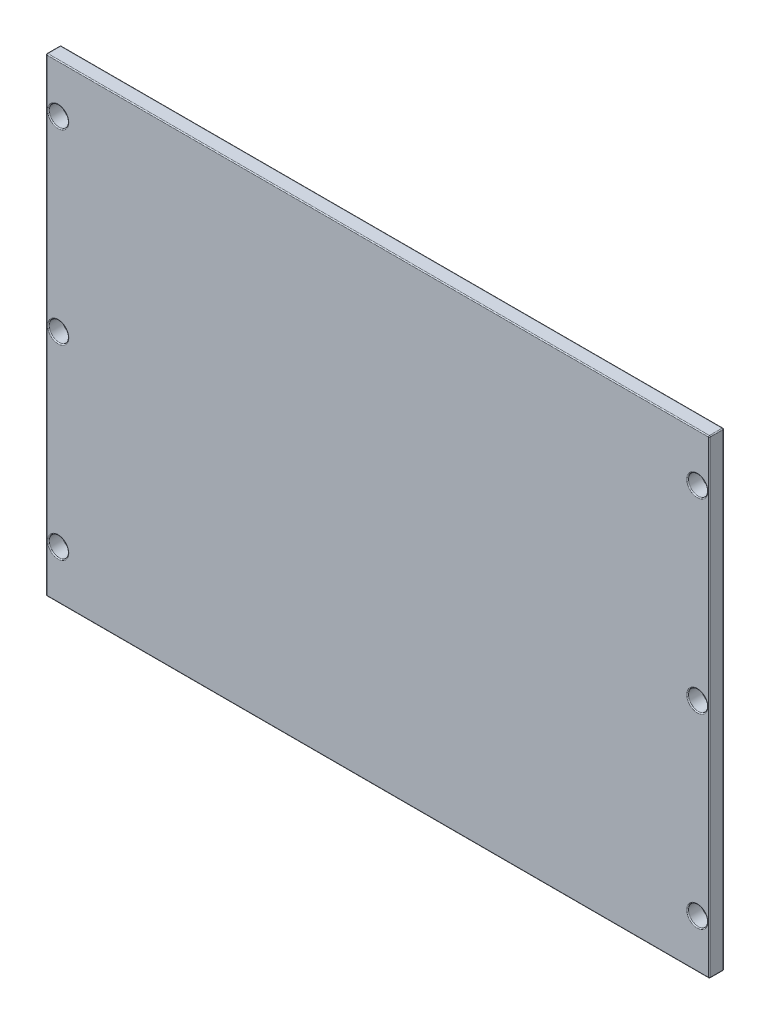
ISO-10303-21;
HEADER;
FILE_DESCRIPTION(('STEP AP214'),'2;1');
FILE_NAME('part.step','',(''),(''),'','','');
FILE_SCHEMA(('AUTOMOTIVE_DESIGN { 1 0 10303 214 1 1 1 1 }'));
ENDSEC;
DATA;
#1=APPLICATION_CONTEXT('core data for automotive mechanical design processes');
#2=APPLICATION_PROTOCOL_DEFINITION('international standard','automotive_design',2000,#1);
#3=PRODUCT_CONTEXT('',#1,'mechanical');
#4=PRODUCT('Part','Part','',(#3));
#5=PRODUCT_RELATED_PRODUCT_CATEGORY('part','',(#4));
#6=PRODUCT_DEFINITION_FORMATION('','',#4);
#7=PRODUCT_DEFINITION_CONTEXT('part definition',#1,'design');
#8=PRODUCT_DEFINITION('design','',#6,#7);
#9=PRODUCT_DEFINITION_SHAPE('','',#8);
#10=(LENGTH_UNIT() NAMED_UNIT(*) SI_UNIT(.MILLI.,.METRE.));
#11=(NAMED_UNIT(*) PLANE_ANGLE_UNIT() SI_UNIT($,.RADIAN.));
#12=(NAMED_UNIT(*) SI_UNIT($,.STERADIAN.) SOLID_ANGLE_UNIT());
#13=UNCERTAINTY_MEASURE_WITH_UNIT(LENGTH_MEASURE(1.E-05),#10,'distance_accuracy_value','');
#14=(GEOMETRIC_REPRESENTATION_CONTEXT(3) GLOBAL_UNCERTAINTY_ASSIGNED_CONTEXT((#13)) GLOBAL_UNIT_ASSIGNED_CONTEXT((#10,
#11,#12)) REPRESENTATION_CONTEXT('',''));
#15=CARTESIAN_POINT('',(0.,0.,0.));
#16=DIRECTION('',(0.,0.,1.));
#17=DIRECTION('',(1.,0.,0.));
#18=AXIS2_PLACEMENT_3D('',#15,#16,#17);
#19=CARTESIAN_POINT('',(167.,2.98999999999998,-197.));
#20=DIRECTION('',(0.,0.,-1.));
#21=DIRECTION('',(-1.,0.,0.));
#22=AXIS2_PLACEMENT_3D('',#19,#20,#21);
#23=PLANE('',#22);
#24=CARTESIAN_POINT('',(32.5,90.,-197.));
#25=DIRECTION('',(0.,0.,-1.));
#26=DIRECTION('',(-1.,0.,0.));
#27=AXIS2_PLACEMENT_3D('',#24,#25,#26);
#28=CIRCLE('',#27,2.2);
#29=CARTESIAN_POINT('',(30.3,90.,-197.));
#30=VERTEX_POINT('',#29);
#31=EDGE_CURVE('E11',#30,#30,#28,.T.);
#32=ORIENTED_EDGE('',*,*,#31,.T.);
#33=EDGE_LOOP('',(#32));
#34=FACE_BOUND('',#33,.T.);
#35=CARTESIAN_POINT('',(32.5,51.5,-197.));
#36=DIRECTION('',(0.,0.,-1.));
#37=DIRECTION('',(-1.,0.,0.));
#38=AXIS2_PLACEMENT_3D('',#35,#36,#37);
#39=CIRCLE('',#38,2.2);
#40=CARTESIAN_POINT('',(30.3,51.5,-197.));
#41=VERTEX_POINT('',#40);
#42=EDGE_CURVE('E44',#41,#41,#39,.T.);
#43=ORIENTED_EDGE('',*,*,#42,.T.);
#44=EDGE_LOOP('',(#43));
#45=FACE_BOUND('',#44,.T.);
#46=CARTESIAN_POINT('',(32.5,13.,-197.));
#47=DIRECTION('',(0.,0.,-1.));
#48=DIRECTION('',(-1.,0.,0.));
#49=AXIS2_PLACEMENT_3D('',#46,#47,#48);
#50=CIRCLE('',#49,2.2);
#51=CARTESIAN_POINT('',(30.3,13.,-197.));
#52=VERTEX_POINT('',#51);
#53=EDGE_CURVE('E268',#52,#52,#50,.T.);
#54=ORIENTED_EDGE('',*,*,#53,.T.);
#55=EDGE_LOOP('',(#54));
#56=FACE_BOUND('',#55,.T.);
#57=CARTESIAN_POINT('',(164.5,13.,-197.));
#58=DIRECTION('',(0.,0.,-1.));
#59=DIRECTION('',(-1.,0.,0.));
#60=AXIS2_PLACEMENT_3D('',#57,#58,#59);
#61=CIRCLE('',#60,2.2);
#62=CARTESIAN_POINT('',(162.3,13.,-197.));
#63=VERTEX_POINT('',#62);
#64=EDGE_CURVE('E265',#63,#63,#61,.T.);
#65=ORIENTED_EDGE('',*,*,#64,.T.);
#66=EDGE_LOOP('',(#65));
#67=FACE_BOUND('',#66,.T.);
#68=CARTESIAN_POINT('',(164.5,51.5,-197.));
#69=DIRECTION('',(0.,0.,-1.));
#70=DIRECTION('',(-1.,0.,0.));
#71=AXIS2_PLACEMENT_3D('',#68,#69,#70);
#72=CIRCLE('',#71,2.2);
#73=CARTESIAN_POINT('',(162.3,51.5,-197.));
#74=VERTEX_POINT('',#73);
#75=EDGE_CURVE('E262',#74,#74,#72,.T.);
#76=ORIENTED_EDGE('',*,*,#75,.T.);
#77=EDGE_LOOP('',(#76));
#78=FACE_BOUND('',#77,.T.);
#79=CARTESIAN_POINT('',(164.5,90.,-197.));
#80=DIRECTION('',(0.,0.,-1.));
#81=DIRECTION('',(-1.,0.,0.));
#82=AXIS2_PLACEMENT_3D('',#79,#80,#81);
#83=CIRCLE('',#82,2.2);
#84=CARTESIAN_POINT('',(162.3,90.,-197.));
#85=VERTEX_POINT('',#84);
#86=EDGE_CURVE('E259',#85,#85,#83,.T.);
#87=ORIENTED_EDGE('',*,*,#86,.T.);
#88=EDGE_LOOP('',(#87));
#89=FACE_BOUND('',#88,.T.);
#90=DIRECTION('',(0.,1.,0.));
#91=VECTOR('',#90,1.);
#92=CARTESIAN_POINT('',(30.2,2.98999999999998,-197.));
#93=LINE('',#92,#91);
#94=CARTESIAN_POINT('',(30.2,99.8,-197.));
#95=VERTEX_POINT('',#94);
#96=CARTESIAN_POINT('',(30.2,3.2,-197.));
#97=VERTEX_POINT('',#96);
#98=EDGE_CURVE('E52',#95,#97,#93,.F.);
#99=ORIENTED_EDGE('',*,*,#98,.T.);
#100=DIRECTION('',(-1.,0.,0.));
#101=VECTOR('',#100,1.);
#102=CARTESIAN_POINT('',(167.,3.19999999999998,-197.));
#103=LINE('',#102,#101);
#104=CARTESIAN_POINT('',(166.8,3.19999999999998,-197.));
#105=VERTEX_POINT('',#104);
#106=EDGE_CURVE('E257',#97,#105,#103,.F.);
#107=ORIENTED_EDGE('',*,*,#106,.T.);
#108=DIRECTION('',(0.,1.,0.));
#109=VECTOR('',#108,1.);
#110=CARTESIAN_POINT('',(166.8,2.98999999999998,-197.));
#111=LINE('',#110,#109);
#112=CARTESIAN_POINT('',(166.8,99.8,-197.));
#113=VERTEX_POINT('',#112);
#114=EDGE_CURVE('E253',#105,#113,#111,.T.);
#115=ORIENTED_EDGE('',*,*,#114,.T.);
#116=DIRECTION('',(-1.,0.,0.));
#117=VECTOR('',#116,1.);
#118=CARTESIAN_POINT('',(167.,99.8,-197.));
#119=LINE('',#118,#117);
#120=EDGE_CURVE('E57',#113,#95,#119,.T.);
#121=ORIENTED_EDGE('',*,*,#120,.T.);
#122=EDGE_LOOP('',(#99,#107,#115,#121));
#123=FACE_BOUND('',#122,.T.);
#124=ADVANCED_FACE('F35',(#34,#45,#56,#67,#78,#89,#123),#23,.F.);
#125=CARTESIAN_POINT('',(30.,2.98999999999998,-206.202765486301));
#126=DIRECTION('',(1.,0.,0.));
#127=DIRECTION('',(0.,0.,-1.));
#128=AXIS2_PLACEMENT_3D('',#125,#126,#127);
#129=PLANE('',#128);
#130=DIRECTION('',(0.,0.,1.));
#131=VECTOR('',#130,1.);
#132=CARTESIAN_POINT('',(30.,99.8,-206.202765486301));
#133=LINE('',#132,#131);
#134=CARTESIAN_POINT('',(30.,99.8,-197.2));
#135=VERTEX_POINT('',#134);
#136=CARTESIAN_POINT('',(30.,99.8,-199.8));
#137=VERTEX_POINT('',#136);
#138=EDGE_CURVE('E183',#135,#137,#133,.F.);
#139=ORIENTED_EDGE('',*,*,#138,.T.);
#140=DIRECTION('',(0.,1.,0.));
#141=VECTOR('',#140,1.);
#142=CARTESIAN_POINT('',(30.,2.98999999999998,-199.8));
#143=LINE('',#142,#141);
#144=CARTESIAN_POINT('',(30.,3.2,-199.8));
#145=VERTEX_POINT('',#144);
#146=EDGE_CURVE('E188',#137,#145,#143,.F.);
#147=ORIENTED_EDGE('',*,*,#146,.T.);
#148=DIRECTION('',(0.,0.,-1.));
#149=VECTOR('',#148,1.);
#150=CARTESIAN_POINT('',(30.,3.2,-206.202765486301));
#151=LINE('',#150,#149);
#152=CARTESIAN_POINT('',(30.,3.2,-197.2));
#153=VERTEX_POINT('',#152);
#154=EDGE_CURVE('E185',#145,#153,#151,.F.);
#155=ORIENTED_EDGE('',*,*,#154,.T.);
#156=DIRECTION('',(0.,1.,0.));
#157=VECTOR('',#156,1.);
#158=CARTESIAN_POINT('',(30.,2.98999999999998,-197.2));
#159=LINE('',#158,#157);
#160=EDGE_CURVE('E181',#153,#135,#159,.T.);
#161=ORIENTED_EDGE('',*,*,#160,.T.);
#162=EDGE_LOOP('',(#139,#147,#155,#161));
#163=FACE_BOUND('',#162,.T.);
#164=ADVANCED_FACE('F354',(#163),#129,.F.);
#165=CARTESIAN_POINT('',(167.,2.98999999999998,-207.082295416591));
#166=DIRECTION('',(-1.,0.,0.));
#167=DIRECTION('',(0.,0.,1.));
#168=AXIS2_PLACEMENT_3D('',#165,#166,#167);
#169=PLANE('',#168);
#170=DIRECTION('',(0.,0.,1.));
#171=VECTOR('',#170,1.);
#172=CARTESIAN_POINT('',(167.,3.19999999999998,-207.082295416591));
#173=LINE('',#172,#171);
#174=CARTESIAN_POINT('',(167.,3.19999999999998,-197.2));
#175=VERTEX_POINT('',#174);
#176=CARTESIAN_POINT('',(167.,3.19999999999998,-199.8));
#177=VERTEX_POINT('',#176);
#178=EDGE_CURVE('E133',#175,#177,#173,.F.);
#179=ORIENTED_EDGE('',*,*,#178,.T.);
#180=DIRECTION('',(0.,-1.,0.));
#181=VECTOR('',#180,1.);
#182=CARTESIAN_POINT('',(167.,2.98999999999998,-199.8));
#183=LINE('',#182,#181);
#184=CARTESIAN_POINT('',(167.,99.8,-199.8));
#185=VERTEX_POINT('',#184);
#186=EDGE_CURVE('E170',#177,#185,#183,.F.);
#187=ORIENTED_EDGE('',*,*,#186,.T.);
#188=DIRECTION('',(0.,0.,-1.));
#189=VECTOR('',#188,1.);
#190=CARTESIAN_POINT('',(167.,99.8,-207.082295416591));
#191=LINE('',#190,#189);
#192=CARTESIAN_POINT('',(167.,99.8,-197.2));
#193=VERTEX_POINT('',#192);
#194=EDGE_CURVE('E167',#185,#193,#191,.F.);
#195=ORIENTED_EDGE('',*,*,#194,.T.);
#196=DIRECTION('',(0.,1.,0.));
#197=VECTOR('',#196,1.);
#198=CARTESIAN_POINT('',(167.,2.98999999999998,-197.2));
#199=LINE('',#198,#197);
#200=EDGE_CURVE('E162',#193,#175,#199,.F.);
#201=ORIENTED_EDGE('',*,*,#200,.T.);
#202=EDGE_LOOP('',(#179,#187,#195,#201));
#203=FACE_BOUND('',#202,.T.);
#204=ADVANCED_FACE('F407',(#203),#169,.F.);
#205=CARTESIAN_POINT('',(8.,100.,-192.));
#206=DIRECTION('',(0.,-1.,0.));
#207=DIRECTION('',(0.,0.,-1.));
#208=AXIS2_PLACEMENT_3D('',#205,#206,#207);
#209=PLANE('',#208);
#210=DIRECTION('',(0.,0.,-1.));
#211=VECTOR('',#210,1.);
#212=CARTESIAN_POINT('',(166.8,100.,-192.));
#213=LINE('',#212,#211);
#214=CARTESIAN_POINT('',(166.8,100.,-197.2));
#215=VERTEX_POINT('',#214);
#216=CARTESIAN_POINT('',(166.8,100.,-199.8));
#217=VERTEX_POINT('',#216);
#218=EDGE_CURVE('E176',#215,#217,#213,.T.);
#219=ORIENTED_EDGE('',*,*,#218,.T.);
#220=DIRECTION('',(-1.,0.,0.));
#221=VECTOR('',#220,1.);
#222=CARTESIAN_POINT('',(8.,100.,-199.8));
#223=LINE('',#222,#221);
#224=CARTESIAN_POINT('',(30.2,100.,-199.8));
#225=VERTEX_POINT('',#224);
#226=EDGE_CURVE('E179',#217,#225,#223,.T.);
#227=ORIENTED_EDGE('',*,*,#226,.T.);
#228=DIRECTION('',(0.,0.,1.));
#229=VECTOR('',#228,1.);
#230=CARTESIAN_POINT('',(30.2,100.,-192.));
#231=LINE('',#230,#229);
#232=CARTESIAN_POINT('',(30.2,100.,-197.2));
#233=VERTEX_POINT('',#232);
#234=EDGE_CURVE('E174',#225,#233,#231,.T.);
#235=ORIENTED_EDGE('',*,*,#234,.T.);
#236=DIRECTION('',(-1.,0.,0.));
#237=VECTOR('',#236,1.);
#238=CARTESIAN_POINT('',(8.,100.,-197.2));
#239=LINE('',#238,#237);
#240=EDGE_CURVE('E172',#233,#215,#239,.F.);
#241=ORIENTED_EDGE('',*,*,#240,.T.);
#242=EDGE_LOOP('',(#219,#227,#235,#241));
#243=FACE_BOUND('',#242,.T.);
#244=ADVANCED_FACE('F372',(#243),#209,.F.);
#245=CARTESIAN_POINT('',(0.,3.,0.01000000000001));
#246=DIRECTION('',(0.,1.,0.));
#247=DIRECTION('',(-1.,0.,0.));
#248=AXIS2_PLACEMENT_3D('',#245,#246,#247);
#249=PLANE('',#248);
#250=DIRECTION('',(0.,0.,-1.));
#251=VECTOR('',#250,1.);
#252=CARTESIAN_POINT('',(30.1999999999999,3.,0.0100000000000214));
#253=LINE('',#252,#251);
#254=CARTESIAN_POINT('',(30.2,3.,-197.2));
#255=VERTEX_POINT('',#254);
#256=CARTESIAN_POINT('',(30.2,3.,-199.8));
#257=VERTEX_POINT('',#256);
#258=EDGE_CURVE('E155',#255,#257,#253,.T.);
#259=ORIENTED_EDGE('',*,*,#258,.T.);
#260=DIRECTION('',(-1.,0.,0.));
#261=VECTOR('',#260,1.);
#262=CARTESIAN_POINT('',(0.,3.,-199.8));
#263=LINE('',#262,#261);
#264=CARTESIAN_POINT('',(166.8,2.99999999999998,-199.8));
#265=VERTEX_POINT('',#264);
#266=EDGE_CURVE('E159',#257,#265,#263,.F.);
#267=ORIENTED_EDGE('',*,*,#266,.T.);
#268=DIRECTION('',(0.,0.,1.));
#269=VECTOR('',#268,1.);
#270=CARTESIAN_POINT('',(166.8,2.99999999999998,0.01000000000001));
#271=LINE('',#270,#269);
#272=CARTESIAN_POINT('',(166.8,2.99999999999998,-197.2));
#273=VERTEX_POINT('',#272);
#274=EDGE_CURVE('E131',#265,#273,#271,.T.);
#275=ORIENTED_EDGE('',*,*,#274,.T.);
#276=DIRECTION('',(-1.,0.,0.));
#277=VECTOR('',#276,1.);
#278=CARTESIAN_POINT('',(0.,3.,-197.2));
#279=LINE('',#278,#277);
#280=EDGE_CURVE('E149',#273,#255,#279,.T.);
#281=ORIENTED_EDGE('',*,*,#280,.T.);
#282=EDGE_LOOP('',(#259,#267,#275,#281));
#283=FACE_BOUND('',#282,.T.);
#284=ADVANCED_FACE('F157',(#283),#249,.F.);
#285=CARTESIAN_POINT('',(8.00000000000006,100.,-200.));
#286=DIRECTION('',(0.,0.,1.));
#287=DIRECTION('',(1.,0.,0.));
#288=AXIS2_PLACEMENT_3D('',#285,#286,#287);
#289=PLANE('',#288);
#290=DIRECTION('',(-1.,0.,0.));
#291=VECTOR('',#290,1.);
#292=CARTESIAN_POINT('',(8.00000000000006,99.8,-200.));
#293=LINE('',#292,#291);
#294=CARTESIAN_POINT('',(30.2,99.8,-200.));
#295=VERTEX_POINT('',#294);
#296=CARTESIAN_POINT('',(166.8,99.8,-200.));
#297=VERTEX_POINT('',#296);
#298=EDGE_CURVE('E212',#295,#297,#293,.F.);
#299=ORIENTED_EDGE('',*,*,#298,.T.);
#300=DIRECTION('',(0.,-1.,0.));
#301=VECTOR('',#300,1.);
#302=CARTESIAN_POINT('',(166.8,100.,-200.));
#303=LINE('',#302,#301);
#304=CARTESIAN_POINT('',(166.8,3.19999999999997,-200.));
#305=VERTEX_POINT('',#304);
#306=EDGE_CURVE('E214',#297,#305,#303,.T.);
#307=ORIENTED_EDGE('',*,*,#306,.T.);
#308=DIRECTION('',(-1.,0.,0.));
#309=VECTOR('',#308,1.);
#310=CARTESIAN_POINT('',(8.00000000000004,3.19999999999999,-200.));
#311=LINE('',#310,#309);
#312=CARTESIAN_POINT('',(30.2,3.19999999999999,-200.));
#313=VERTEX_POINT('',#312);
#314=EDGE_CURVE('E208',#305,#313,#311,.T.);
#315=ORIENTED_EDGE('',*,*,#314,.T.);
#316=DIRECTION('',(0.,1.,0.));
#317=VECTOR('',#316,1.);
#318=CARTESIAN_POINT('',(30.2,100.,-200.));
#319=LINE('',#318,#317);
#320=EDGE_CURVE('E210',#313,#295,#319,.T.);
#321=ORIENTED_EDGE('',*,*,#320,.T.);
#322=EDGE_LOOP('',(#299,#307,#315,#321));
#323=FACE_BOUND('',#322,.T.);
#324=CARTESIAN_POINT('',(164.5,90.,-200.));
#325=DIRECTION('',(0.,0.,1.));
#326=DIRECTION('',(1.,0.,0.));
#327=AXIS2_PLACEMENT_3D('',#324,#325,#326);
#328=CIRCLE('',#327,2.2);
#329=CARTESIAN_POINT('',(166.7,90.,-200.));
#330=VERTEX_POINT('',#329);
#331=EDGE_CURVE('E205',#330,#330,#328,.T.);
#332=ORIENTED_EDGE('',*,*,#331,.T.);
#333=EDGE_LOOP('',(#332));
#334=FACE_BOUND('',#333,.T.);
#335=CARTESIAN_POINT('',(164.5,51.5,-200.));
#336=DIRECTION('',(0.,0.,1.));
#337=DIRECTION('',(1.,0.,0.));
#338=AXIS2_PLACEMENT_3D('',#335,#336,#337);
#339=CIRCLE('',#338,2.2);
#340=CARTESIAN_POINT('',(166.7,51.5,-200.));
#341=VERTEX_POINT('',#340);
#342=EDGE_CURVE('E202',#341,#341,#339,.T.);
#343=ORIENTED_EDGE('',*,*,#342,.T.);
#344=EDGE_LOOP('',(#343));
#345=FACE_BOUND('',#344,.T.);
#346=CARTESIAN_POINT('',(164.5,13.,-200.));
#347=DIRECTION('',(0.,0.,1.));
#348=DIRECTION('',(1.,0.,0.));
#349=AXIS2_PLACEMENT_3D('',#346,#347,#348);
#350=CIRCLE('',#349,2.2);
#351=CARTESIAN_POINT('',(166.7,13.,-200.));
#352=VERTEX_POINT('',#351);
#353=EDGE_CURVE('E199',#352,#352,#350,.T.);
#354=ORIENTED_EDGE('',*,*,#353,.T.);
#355=EDGE_LOOP('',(#354));
#356=FACE_BOUND('',#355,.T.);
#357=CARTESIAN_POINT('',(32.5,13.,-200.));
#358=DIRECTION('',(0.,0.,1.));
#359=DIRECTION('',(1.,0.,0.));
#360=AXIS2_PLACEMENT_3D('',#357,#358,#359);
#361=CIRCLE('',#360,2.2);
#362=CARTESIAN_POINT('',(34.7,13.,-200.));
#363=VERTEX_POINT('',#362);
#364=EDGE_CURVE('E196',#363,#363,#361,.T.);
#365=ORIENTED_EDGE('',*,*,#364,.T.);
#366=EDGE_LOOP('',(#365));
#367=FACE_BOUND('',#366,.T.);
#368=CARTESIAN_POINT('',(32.5,51.5,-200.));
#369=DIRECTION('',(0.,0.,1.));
#370=DIRECTION('',(1.,0.,0.));
#371=AXIS2_PLACEMENT_3D('',#368,#369,#370);
#372=CIRCLE('',#371,2.2);
#373=CARTESIAN_POINT('',(34.7,51.5,-200.));
#374=VERTEX_POINT('',#373);
#375=EDGE_CURVE('E193',#374,#374,#372,.T.);
#376=ORIENTED_EDGE('',*,*,#375,.T.);
#377=EDGE_LOOP('',(#376));
#378=FACE_BOUND('',#377,.T.);
#379=CARTESIAN_POINT('',(32.5,90.,-200.));
#380=DIRECTION('',(0.,0.,1.));
#381=DIRECTION('',(1.,0.,0.));
#382=AXIS2_PLACEMENT_3D('',#379,#380,#381);
#383=CIRCLE('',#382,2.2);
#384=CARTESIAN_POINT('',(34.7,90.,-200.));
#385=VERTEX_POINT('',#384);
#386=EDGE_CURVE('E190',#385,#385,#383,.T.);
#387=ORIENTED_EDGE('',*,*,#386,.T.);
#388=EDGE_LOOP('',(#387));
#389=FACE_BOUND('',#388,.T.);
#390=ADVANCED_FACE('F344',(#323,#334,#345,#356,#367,#378,#389),#289,.F.);
#391=CARTESIAN_POINT('',(164.5,90.,-197.));
#392=DIRECTION('',(0.,0.,1.));
#393=DIRECTION('',(1.,0.,0.));
#394=AXIS2_PLACEMENT_3D('',#391,#392,#393);
#395=CYLINDRICAL_SURFACE('',#394,2.);
#396=CARTESIAN_POINT('',(164.5,90.,-199.8));
#397=DIRECTION('',(0.,0.,1.));
#398=DIRECTION('',(1.,0.,0.));
#399=AXIS2_PLACEMENT_3D('',#396,#397,#398);
#400=CIRCLE('',#399,2.);
#401=CARTESIAN_POINT('',(166.5,90.,-199.8));
#402=VERTEX_POINT('',#401);
#403=EDGE_CURVE('E220',#402,#402,#400,.F.);
#404=ORIENTED_EDGE('',*,*,#403,.T.);
#405=EDGE_LOOP('',(#404));
#406=FACE_BOUND('',#405,.T.);
#407=CARTESIAN_POINT('',(164.5,90.,-197.2));
#408=DIRECTION('',(0.,0.,-1.));
#409=DIRECTION('',(-1.,0.,0.));
#410=AXIS2_PLACEMENT_3D('',#407,#408,#409);
#411=CIRCLE('',#410,2.);
#412=CARTESIAN_POINT('',(162.5,90.,-197.2));
#413=VERTEX_POINT('',#412);
#414=EDGE_CURVE('E217',#413,#413,#411,.F.);
#415=ORIENTED_EDGE('',*,*,#414,.T.);
#416=EDGE_LOOP('',(#415));
#417=FACE_BOUND('',#416,.T.);
#418=ADVANCED_FACE('F414',(#406,#417),#395,.F.);
#419=CARTESIAN_POINT('',(164.5,51.5,-197.));
#420=DIRECTION('',(0.,0.,1.));
#421=DIRECTION('',(1.,0.,0.));
#422=AXIS2_PLACEMENT_3D('',#419,#420,#421);
#423=CYLINDRICAL_SURFACE('',#422,2.);
#424=CARTESIAN_POINT('',(164.5,51.5,-199.8));
#425=DIRECTION('',(0.,0.,1.));
#426=DIRECTION('',(1.,0.,0.));
#427=AXIS2_PLACEMENT_3D('',#424,#425,#426);
#428=CIRCLE('',#427,2.);
#429=CARTESIAN_POINT('',(166.5,51.5,-199.8));
#430=VERTEX_POINT('',#429);
#431=EDGE_CURVE('E226',#430,#430,#428,.F.);
#432=ORIENTED_EDGE('',*,*,#431,.T.);
#433=EDGE_LOOP('',(#432));
#434=FACE_BOUND('',#433,.T.);
#435=CARTESIAN_POINT('',(164.5,51.5,-197.2));
#436=DIRECTION('',(0.,0.,-1.));
#437=DIRECTION('',(-1.,0.,0.));
#438=AXIS2_PLACEMENT_3D('',#435,#436,#437);
#439=CIRCLE('',#438,2.);
#440=CARTESIAN_POINT('',(162.5,51.5,-197.2));
#441=VERTEX_POINT('',#440);
#442=EDGE_CURVE('E223',#441,#441,#439,.F.);
#443=ORIENTED_EDGE('',*,*,#442,.T.);
#444=EDGE_LOOP('',(#443));
#445=FACE_BOUND('',#444,.T.);
#446=ADVANCED_FACE('F466',(#434,#445),#423,.F.);
#447=CARTESIAN_POINT('',(164.5,13.,-197.));
#448=DIRECTION('',(0.,0.,1.));
#449=DIRECTION('',(1.,0.,0.));
#450=AXIS2_PLACEMENT_3D('',#447,#448,#449);
#451=CYLINDRICAL_SURFACE('',#450,2.);
#452=CARTESIAN_POINT('',(164.5,13.,-199.8));
#453=DIRECTION('',(0.,0.,1.));
#454=DIRECTION('',(1.,0.,0.));
#455=AXIS2_PLACEMENT_3D('',#452,#453,#454);
#456=CIRCLE('',#455,2.);
#457=CARTESIAN_POINT('',(166.5,13.,-199.8));
#458=VERTEX_POINT('',#457);
#459=EDGE_CURVE('E232',#458,#458,#456,.F.);
#460=ORIENTED_EDGE('',*,*,#459,.T.);
#461=EDGE_LOOP('',(#460));
#462=FACE_BOUND('',#461,.T.);
#463=CARTESIAN_POINT('',(164.5,13.,-197.2));
#464=DIRECTION('',(0.,0.,-1.));
#465=DIRECTION('',(-1.,0.,0.));
#466=AXIS2_PLACEMENT_3D('',#463,#464,#465);
#467=CIRCLE('',#466,2.);
#468=CARTESIAN_POINT('',(162.5,13.,-197.2));
#469=VERTEX_POINT('',#468);
#470=EDGE_CURVE('E229',#469,#469,#467,.F.);
#471=ORIENTED_EDGE('',*,*,#470,.T.);
#472=EDGE_LOOP('',(#471));
#473=FACE_BOUND('',#472,.T.);
#474=ADVANCED_FACE('F474',(#462,#473),#451,.F.);
#475=CARTESIAN_POINT('',(32.5,13.,-197.));
#476=DIRECTION('',(0.,0.,1.));
#477=DIRECTION('',(1.,0.,0.));
#478=AXIS2_PLACEMENT_3D('',#475,#476,#477);
#479=CYLINDRICAL_SURFACE('',#478,2.);
#480=CARTESIAN_POINT('',(32.5,13.,-199.8));
#481=DIRECTION('',(0.,0.,1.));
#482=DIRECTION('',(1.,0.,0.));
#483=AXIS2_PLACEMENT_3D('',#480,#481,#482);
#484=CIRCLE('',#483,2.);
#485=CARTESIAN_POINT('',(34.5,13.,-199.8));
#486=VERTEX_POINT('',#485);
#487=EDGE_CURVE('E238',#486,#486,#484,.F.);
#488=ORIENTED_EDGE('',*,*,#487,.T.);
#489=EDGE_LOOP('',(#488));
#490=FACE_BOUND('',#489,.T.);
#491=CARTESIAN_POINT('',(32.5,13.,-197.2));
#492=DIRECTION('',(0.,0.,-1.));
#493=DIRECTION('',(-1.,0.,0.));
#494=AXIS2_PLACEMENT_3D('',#491,#492,#493);
#495=CIRCLE('',#494,2.);
#496=CARTESIAN_POINT('',(30.5,13.,-197.2));
#497=VERTEX_POINT('',#496);
#498=EDGE_CURVE('E235',#497,#497,#495,.F.);
#499=ORIENTED_EDGE('',*,*,#498,.T.);
#500=EDGE_LOOP('',(#499));
#501=FACE_BOUND('',#500,.T.);
#502=ADVANCED_FACE('F482',(#490,#501),#479,.F.);
#503=CARTESIAN_POINT('',(32.5,51.5,-197.));
#504=DIRECTION('',(0.,0.,1.));
#505=DIRECTION('',(1.,0.,0.));
#506=AXIS2_PLACEMENT_3D('',#503,#504,#505);
#507=CYLINDRICAL_SURFACE('',#506,2.);
#508=CARTESIAN_POINT('',(32.5,51.5,-199.8));
#509=DIRECTION('',(0.,0.,1.));
#510=DIRECTION('',(1.,0.,0.));
#511=AXIS2_PLACEMENT_3D('',#508,#509,#510);
#512=CIRCLE('',#511,2.);
#513=CARTESIAN_POINT('',(34.5,51.5,-199.8));
#514=VERTEX_POINT('',#513);
#515=EDGE_CURVE('E244',#514,#514,#512,.F.);
#516=ORIENTED_EDGE('',*,*,#515,.T.);
#517=EDGE_LOOP('',(#516));
#518=FACE_BOUND('',#517,.T.);
#519=CARTESIAN_POINT('',(32.5,51.5,-197.2));
#520=DIRECTION('',(0.,0.,-1.));
#521=DIRECTION('',(-1.,0.,0.));
#522=AXIS2_PLACEMENT_3D('',#519,#520,#521);
#523=CIRCLE('',#522,2.);
#524=CARTESIAN_POINT('',(30.5,51.5,-197.2));
#525=VERTEX_POINT('',#524);
#526=EDGE_CURVE('E241',#525,#525,#523,.F.);
#527=ORIENTED_EDGE('',*,*,#526,.T.);
#528=EDGE_LOOP('',(#527));
#529=FACE_BOUND('',#528,.T.);
#530=ADVANCED_FACE('F490',(#518,#529),#507,.F.);
#531=CARTESIAN_POINT('',(32.5,90.,-197.));
#532=DIRECTION('',(0.,0.,1.));
#533=DIRECTION('',(1.,0.,0.));
#534=AXIS2_PLACEMENT_3D('',#531,#532,#533);
#535=CYLINDRICAL_SURFACE('',#534,2.);
#536=CARTESIAN_POINT('',(32.5,90.,-199.8));
#537=DIRECTION('',(0.,0.,1.));
#538=DIRECTION('',(1.,0.,0.));
#539=AXIS2_PLACEMENT_3D('',#536,#537,#538);
#540=CIRCLE('',#539,2.);
#541=CARTESIAN_POINT('',(34.5,90.,-199.8));
#542=VERTEX_POINT('',#541);
#543=EDGE_CURVE('E250',#542,#542,#540,.F.);
#544=ORIENTED_EDGE('',*,*,#543,.T.);
#545=EDGE_LOOP('',(#544));
#546=FACE_BOUND('',#545,.T.);
#547=CARTESIAN_POINT('',(32.5,90.,-197.2));
#548=DIRECTION('',(0.,0.,-1.));
#549=DIRECTION('',(-1.,0.,0.));
#550=AXIS2_PLACEMENT_3D('',#547,#548,#549);
#551=CIRCLE('',#550,2.);
#552=CARTESIAN_POINT('',(30.5,90.,-197.2));
#553=VERTEX_POINT('',#552);
#554=EDGE_CURVE('E247',#553,#553,#551,.F.);
#555=ORIENTED_EDGE('',*,*,#554,.T.);
#556=EDGE_LOOP('',(#555));
#557=FACE_BOUND('',#556,.T.);
#558=ADVANCED_FACE('F498',(#546,#557),#535,.F.);
#559=CARTESIAN_POINT('',(30.2,99.8,-192.));
#560=DIRECTION('',(0.,0.,1.));
#561=DIRECTION('',(1.,0.,0.));
#562=AXIS2_PLACEMENT_3D('',#559,#560,#561);
#563=CYLINDRICAL_SURFACE('',#562,0.2);
#564=CARTESIAN_POINT('',(30.2,99.8,-199.8));
#565=DIRECTION('',(0.,0.,-1.));
#566=DIRECTION('',(-1.,0.,0.));
#567=AXIS2_PLACEMENT_3D('',#564,#565,#566);
#568=CIRCLE('',#567,0.2);
#569=EDGE_CURVE('E39',#137,#225,#568,.T.);
#570=ORIENTED_EDGE('',*,*,#569,.F.);
#571=ORIENTED_EDGE('',*,*,#138,.F.);
#572=CARTESIAN_POINT('',(30.2,99.8,-197.2));
#573=DIRECTION('',(0.,0.,1.));
#574=DIRECTION('',(1.,0.,0.));
#575=AXIS2_PLACEMENT_3D('',#572,#573,#574);
#576=CIRCLE('',#575,0.2);
#577=EDGE_CURVE('E321',#233,#135,#576,.T.);
#578=ORIENTED_EDGE('',*,*,#577,.F.);
#579=ORIENTED_EDGE('',*,*,#234,.F.);
#580=EDGE_LOOP('',(#570,#571,#578,#579));
#581=FACE_BOUND('',#580,.T.);
#582=ADVANCED_FACE('F364',(#581),#563,.T.);
#583=CARTESIAN_POINT('',(30.2,99.8,-199.8));
#584=DIRECTION('',(0.,1.,0.));
#585=DIRECTION('',(-1.,0.,0.));
#586=AXIS2_PLACEMENT_3D('',#583,#584,#585);
#587=SPHERICAL_SURFACE('',#586,0.2);
#588=CARTESIAN_POINT('',(30.2,99.8,-199.8));
#589=DIRECTION('',(0.,1.,0.));
#590=DIRECTION('',(0.,0.,1.));
#591=AXIS2_PLACEMENT_3D('',#588,#589,#590);
#592=CIRCLE('',#591,0.2);
#593=EDGE_CURVE('E316',#137,#295,#592,.F.);
#594=ORIENTED_EDGE('',*,*,#593,.F.);
#595=ORIENTED_EDGE('',*,*,#569,.T.);
#596=CARTESIAN_POINT('',(30.2,99.8,-199.8));
#597=DIRECTION('',(-1.,0.,0.));
#598=DIRECTION('',(0.,0.,1.));
#599=AXIS2_PLACEMENT_3D('',#596,#597,#598);
#600=CIRCLE('',#599,0.2);
#601=EDGE_CURVE('E319',#295,#225,#600,.F.);
#602=ORIENTED_EDGE('',*,*,#601,.F.);
#603=EDGE_LOOP('',(#594,#595,#602));
#604=FACE_BOUND('',#603,.T.);
#605=ADVANCED_FACE('F332',(#604),#587,.T.);
#606=CARTESIAN_POINT('',(30.2,99.8,-197.2));
#607=DIRECTION('',(-1.,0.,0.));
#608=DIRECTION('',(0.,0.,1.));
#609=AXIS2_PLACEMENT_3D('',#606,#607,#608);
#610=SPHERICAL_SURFACE('',#609,0.2);
#611=CARTESIAN_POINT('',(30.2,99.8,-197.2));
#612=DIRECTION('',(-1.,0.,0.));
#613=DIRECTION('',(0.,-1.,0.));
#614=AXIS2_PLACEMENT_3D('',#611,#612,#613);
#615=CIRCLE('',#614,0.2);
#616=EDGE_CURVE('E311',#233,#95,#615,.F.);
#617=ORIENTED_EDGE('',*,*,#616,.F.);
#618=ORIENTED_EDGE('',*,*,#577,.T.);
#619=CARTESIAN_POINT('',(30.2,99.8,-197.2));
#620=DIRECTION('',(0.,1.,0.));
#621=DIRECTION('',(0.,0.,1.));
#622=AXIS2_PLACEMENT_3D('',#619,#620,#621);
#623=CIRCLE('',#622,0.2);
#624=EDGE_CURVE('E313',#95,#135,#623,.F.);
#625=ORIENTED_EDGE('',*,*,#624,.F.);
#626=EDGE_LOOP('',(#617,#618,#625));
#627=FACE_BOUND('',#626,.T.);
#628=ADVANCED_FACE('F366',(#627),#610,.T.);
#629=CARTESIAN_POINT('',(8.,99.8,-199.8));
#630=DIRECTION('',(-1.,0.,0.));
#631=DIRECTION('',(0.,0.,1.));
#632=AXIS2_PLACEMENT_3D('',#629,#630,#631);
#633=CYLINDRICAL_SURFACE('',#632,0.2);
#634=ORIENTED_EDGE('',*,*,#601,.T.);
#635=ORIENTED_EDGE('',*,*,#226,.F.);
#636=CARTESIAN_POINT('',(166.8,99.8,-199.8));
#637=DIRECTION('',(1.,0.,0.));
#638=DIRECTION('',(0.,0.,-1.));
#639=AXIS2_PLACEMENT_3D('',#636,#637,#638);
#640=CIRCLE('',#639,0.2);
#641=EDGE_CURVE('E306',#297,#217,#640,.T.);
#642=ORIENTED_EDGE('',*,*,#641,.F.);
#643=ORIENTED_EDGE('',*,*,#298,.F.);
#644=EDGE_LOOP('',(#634,#635,#642,#643));
#645=FACE_BOUND('',#644,.T.);
#646=ADVANCED_FACE('F340',(#645),#633,.T.);
#647=CARTESIAN_POINT('',(30.2,100.,-199.8));
#648=DIRECTION('',(0.,1.,0.));
#649=DIRECTION('',(0.,0.,1.));
#650=AXIS2_PLACEMENT_3D('',#647,#648,#649);
#651=CYLINDRICAL_SURFACE('',#650,0.2);
#652=ORIENTED_EDGE('',*,*,#593,.T.);
#653=ORIENTED_EDGE('',*,*,#320,.F.);
#654=CARTESIAN_POINT('',(30.2,3.2,-199.8));
#655=DIRECTION('',(0.,-1.,0.));
#656=DIRECTION('',(0.,0.,-1.));
#657=AXIS2_PLACEMENT_3D('',#654,#655,#656);
#658=CIRCLE('',#657,0.2);
#659=EDGE_CURVE('E303',#145,#313,#658,.T.);
#660=ORIENTED_EDGE('',*,*,#659,.F.);
#661=ORIENTED_EDGE('',*,*,#146,.F.);
#662=EDGE_LOOP('',(#652,#653,#660,#661));
#663=FACE_BOUND('',#662,.T.);
#664=ADVANCED_FACE('F351',(#663),#651,.T.);
#665=CARTESIAN_POINT('',(30.1999999999999,3.2,0.0100000000000214));
#666=DIRECTION('',(0.,0.,-1.));
#667=DIRECTION('',(-1.,0.,0.));
#668=AXIS2_PLACEMENT_3D('',#665,#666,#667);
#669=CYLINDRICAL_SURFACE('',#668,0.2);
#670=CARTESIAN_POINT('',(30.2,3.2,-197.2));
#671=DIRECTION('',(0.,0.,1.));
#672=DIRECTION('',(1.,0.,0.));
#673=AXIS2_PLACEMENT_3D('',#670,#671,#672);
#674=CIRCLE('',#673,0.2);
#675=EDGE_CURVE('E297',#153,#255,#674,.T.);
#676=ORIENTED_EDGE('',*,*,#675,.F.);
#677=ORIENTED_EDGE('',*,*,#154,.F.);
#678=CARTESIAN_POINT('',(30.2,3.2,-199.8));
#679=DIRECTION('',(0.,0.,-1.));
#680=DIRECTION('',(-1.,0.,0.));
#681=AXIS2_PLACEMENT_3D('',#678,#679,#680);
#682=CIRCLE('',#681,0.2);
#683=EDGE_CURVE('E300',#257,#145,#682,.T.);
#684=ORIENTED_EDGE('',*,*,#683,.F.);
#685=ORIENTED_EDGE('',*,*,#258,.F.);
#686=EDGE_LOOP('',(#676,#677,#684,#685));
#687=FACE_BOUND('',#686,.T.);
#688=ADVANCED_FACE('F358',(#687),#669,.T.);
#689=CARTESIAN_POINT('',(30.2,2.98999999999998,-197.2));
#690=DIRECTION('',(0.,1.,0.));
#691=DIRECTION('',(0.,0.,1.));
#692=AXIS2_PLACEMENT_3D('',#689,#690,#691);
#693=CYLINDRICAL_SURFACE('',#692,0.2);
#694=ORIENTED_EDGE('',*,*,#624,.T.);
#695=ORIENTED_EDGE('',*,*,#160,.F.);
#696=CARTESIAN_POINT('',(30.2,3.2,-197.2));
#697=DIRECTION('',(0.,-1.,0.));
#698=DIRECTION('',(1.,0.,0.));
#699=AXIS2_PLACEMENT_3D('',#696,#697,#698);
#700=CIRCLE('',#699,0.2);
#701=EDGE_CURVE('E295',#97,#153,#700,.T.);
#702=ORIENTED_EDGE('',*,*,#701,.F.);
#703=ORIENTED_EDGE('',*,*,#98,.F.);
#704=EDGE_LOOP('',(#694,#695,#702,#703));
#705=FACE_BOUND('',#704,.T.);
#706=ADVANCED_FACE('F363',(#705),#693,.T.);
#707=CARTESIAN_POINT('',(167.,99.8,-197.2));
#708=DIRECTION('',(-1.,0.,0.));
#709=DIRECTION('',(0.,0.,1.));
#710=AXIS2_PLACEMENT_3D('',#707,#708,#709);
#711=CYLINDRICAL_SURFACE('',#710,0.2);
#712=ORIENTED_EDGE('',*,*,#616,.T.);
#713=ORIENTED_EDGE('',*,*,#120,.F.);
#714=CARTESIAN_POINT('',(166.8,99.8,-197.2));
#715=DIRECTION('',(1.,0.,0.));
#716=DIRECTION('',(0.,0.,-1.));
#717=AXIS2_PLACEMENT_3D('',#714,#715,#716);
#718=CIRCLE('',#717,0.2);
#719=EDGE_CURVE('E292',#215,#113,#718,.T.);
#720=ORIENTED_EDGE('',*,*,#719,.F.);
#721=ORIENTED_EDGE('',*,*,#240,.F.);
#722=EDGE_LOOP('',(#712,#713,#720,#721));
#723=FACE_BOUND('',#722,.T.);
#724=ADVANCED_FACE('F369',(#723),#711,.T.);
#725=CARTESIAN_POINT('',(166.8,99.8,-192.));
#726=DIRECTION('',(0.,0.,-1.));
#727=DIRECTION('',(-1.,0.,0.));
#728=AXIS2_PLACEMENT_3D('',#725,#726,#727);
#729=CYLINDRICAL_SURFACE('',#728,0.2);
#730=CARTESIAN_POINT('',(166.8,99.8,-199.8));
#731=DIRECTION('',(0.,0.,-1.));
#732=DIRECTION('',(-1.,0.,0.));
#733=AXIS2_PLACEMENT_3D('',#730,#731,#732);
#734=CIRCLE('',#733,0.2);
#735=EDGE_CURVE('E308',#217,#185,#734,.T.);
#736=ORIENTED_EDGE('',*,*,#735,.F.);
#737=ORIENTED_EDGE('',*,*,#218,.F.);
#738=CARTESIAN_POINT('',(166.8,99.8,-197.2));
#739=DIRECTION('',(0.,0.,1.));
#740=DIRECTION('',(1.,0.,0.));
#741=AXIS2_PLACEMENT_3D('',#738,#739,#740);
#742=CIRCLE('',#741,0.2);
#743=EDGE_CURVE('E289',#193,#215,#742,.T.);
#744=ORIENTED_EDGE('',*,*,#743,.F.);
#745=ORIENTED_EDGE('',*,*,#194,.F.);
#746=EDGE_LOOP('',(#736,#737,#744,#745));
#747=FACE_BOUND('',#746,.T.);
#748=ADVANCED_FACE('F376',(#747),#729,.T.);
#749=CARTESIAN_POINT('',(166.8,99.8,-199.8));
#750=DIRECTION('',(0.,1.,0.));
#751=DIRECTION('',(0.,0.,1.));
#752=AXIS2_PLACEMENT_3D('',#749,#750,#751);
#753=SPHERICAL_SURFACE('',#752,0.2);
#754=ORIENTED_EDGE('',*,*,#641,.T.);
#755=ORIENTED_EDGE('',*,*,#735,.T.);
#756=CARTESIAN_POINT('',(166.8,99.8,-199.8));
#757=DIRECTION('',(0.,1.,0.));
#758=DIRECTION('',(0.,0.,1.));
#759=AXIS2_PLACEMENT_3D('',#756,#757,#758);
#760=CIRCLE('',#759,0.2);
#761=EDGE_CURVE('E286',#297,#185,#760,.F.);
#762=ORIENTED_EDGE('',*,*,#761,.F.);
#763=EDGE_LOOP('',(#754,#755,#762));
#764=FACE_BOUND('',#763,.T.);
#765=ADVANCED_FACE('F380',(#764),#753,.T.);
#766=CARTESIAN_POINT('',(30.2,3.2,-199.8));
#767=DIRECTION('',(-1.,0.,0.));
#768=DIRECTION('',(0.,0.,1.));
#769=AXIS2_PLACEMENT_3D('',#766,#767,#768);
#770=SPHERICAL_SURFACE('',#769,0.2);
#771=ORIENTED_EDGE('',*,*,#683,.T.);
#772=ORIENTED_EDGE('',*,*,#659,.T.);
#773=CARTESIAN_POINT('',(30.2,3.19999999999999,-199.8));
#774=DIRECTION('',(-1.,0.,0.));
#775=DIRECTION('',(0.,-1.,0.));
#776=AXIS2_PLACEMENT_3D('',#773,#774,#775);
#777=CIRCLE('',#776,0.2);
#778=EDGE_CURVE('E283',#257,#313,#777,.F.);
#779=ORIENTED_EDGE('',*,*,#778,.F.);
#780=EDGE_LOOP('',(#771,#772,#779));
#781=FACE_BOUND('',#780,.T.);
#782=ADVANCED_FACE('F390',(#781),#770,.T.);
#783=CARTESIAN_POINT('',(30.2,3.2,-197.2));
#784=DIRECTION('',(-1.,0.,0.));
#785=DIRECTION('',(0.,0.,1.));
#786=AXIS2_PLACEMENT_3D('',#783,#784,#785);
#787=SPHERICAL_SURFACE('',#786,0.2);
#788=ORIENTED_EDGE('',*,*,#701,.T.);
#789=ORIENTED_EDGE('',*,*,#675,.T.);
#790=CARTESIAN_POINT('',(30.2,3.2,-197.2));
#791=DIRECTION('',(-1.,0.,0.));
#792=DIRECTION('',(0.,0.,1.));
#793=AXIS2_PLACEMENT_3D('',#790,#791,#792);
#794=CIRCLE('',#793,0.2);
#795=EDGE_CURVE('E152',#97,#255,#794,.F.);
#796=ORIENTED_EDGE('',*,*,#795,.F.);
#797=EDGE_LOOP('',(#788,#789,#796));
#798=FACE_BOUND('',#797,.T.);
#799=ADVANCED_FACE('F392',(#798),#787,.T.);
#800=CARTESIAN_POINT('',(166.8,99.8,-197.2));
#801=DIRECTION('',(0.,1.,0.));
#802=DIRECTION('',(0.,0.,1.));
#803=AXIS2_PLACEMENT_3D('',#800,#801,#802);
#804=SPHERICAL_SURFACE('',#803,0.2);
#805=ORIENTED_EDGE('',*,*,#743,.T.);
#806=ORIENTED_EDGE('',*,*,#719,.T.);
#807=CARTESIAN_POINT('',(166.8,99.8,-197.2));
#808=DIRECTION('',(0.,1.,0.));
#809=DIRECTION('',(0.,0.,1.));
#810=AXIS2_PLACEMENT_3D('',#807,#808,#809);
#811=CIRCLE('',#810,0.2);
#812=EDGE_CURVE('E279',#193,#113,#811,.F.);
#813=ORIENTED_EDGE('',*,*,#812,.F.);
#814=EDGE_LOOP('',(#805,#806,#813));
#815=FACE_BOUND('',#814,.T.);
#816=ADVANCED_FACE('F398',(#815),#804,.T.);
#817=CARTESIAN_POINT('',(166.8,100.,-199.8));
#818=DIRECTION('',(0.,-1.,0.));
#819=DIRECTION('',(0.,0.,-1.));
#820=AXIS2_PLACEMENT_3D('',#817,#818,#819);
#821=CYLINDRICAL_SURFACE('',#820,0.2);
#822=ORIENTED_EDGE('',*,*,#761,.T.);
#823=ORIENTED_EDGE('',*,*,#186,.F.);
#824=CARTESIAN_POINT('',(166.8,3.19999999999997,-199.8));
#825=DIRECTION('',(0.,-1.,0.));
#826=DIRECTION('',(1.,0.,0.));
#827=AXIS2_PLACEMENT_3D('',#824,#825,#826);
#828=CIRCLE('',#827,0.2);
#829=EDGE_CURVE('E276',#305,#177,#828,.T.);
#830=ORIENTED_EDGE('',*,*,#829,.F.);
#831=ORIENTED_EDGE('',*,*,#306,.F.);
#832=EDGE_LOOP('',(#822,#823,#830,#831));
#833=FACE_BOUND('',#832,.T.);
#834=ADVANCED_FACE('F383',(#833),#821,.T.);
#835=CARTESIAN_POINT('',(8.00000000000004,3.19999999999999,-199.8));
#836=DIRECTION('',(-1.,0.,0.));
#837=DIRECTION('',(0.,-1.,0.));
#838=AXIS2_PLACEMENT_3D('',#835,#836,#837);
#839=CYLINDRICAL_SURFACE('',#838,0.2);
#840=ORIENTED_EDGE('',*,*,#778,.T.);
#841=ORIENTED_EDGE('',*,*,#314,.F.);
#842=CARTESIAN_POINT('',(166.8,3.19999999999998,-199.8));
#843=DIRECTION('',(1.,0.,0.));
#844=DIRECTION('',(0.,0.,-1.));
#845=AXIS2_PLACEMENT_3D('',#842,#843,#844);
#846=CIRCLE('',#845,0.2);
#847=EDGE_CURVE('E146',#265,#305,#846,.T.);
#848=ORIENTED_EDGE('',*,*,#847,.F.);
#849=ORIENTED_EDGE('',*,*,#266,.F.);
#850=EDGE_LOOP('',(#840,#841,#848,#849));
#851=FACE_BOUND('',#850,.T.);
#852=ADVANCED_FACE('F388',(#851),#839,.T.);
#853=CARTESIAN_POINT('',(0.,3.2,-197.2));
#854=DIRECTION('',(-1.,0.,0.));
#855=DIRECTION('',(0.,-1.,0.));
#856=AXIS2_PLACEMENT_3D('',#853,#854,#855);
#857=CYLINDRICAL_SURFACE('',#856,0.2);
#858=ORIENTED_EDGE('',*,*,#795,.T.);
#859=ORIENTED_EDGE('',*,*,#280,.F.);
#860=CARTESIAN_POINT('',(166.8,3.19999999999998,-197.2));
#861=DIRECTION('',(1.,0.,0.));
#862=DIRECTION('',(0.,0.,-1.));
#863=AXIS2_PLACEMENT_3D('',#860,#861,#862);
#864=CIRCLE('',#863,0.2);
#865=EDGE_CURVE('E138',#105,#273,#864,.T.);
#866=ORIENTED_EDGE('',*,*,#865,.F.);
#867=ORIENTED_EDGE('',*,*,#106,.F.);
#868=EDGE_LOOP('',(#858,#859,#866,#867));
#869=FACE_BOUND('',#868,.T.);
#870=ADVANCED_FACE('F150',(#869),#857,.T.);
#871=CARTESIAN_POINT('',(166.8,2.98999999999998,-197.2));
#872=DIRECTION('',(0.,1.,0.));
#873=DIRECTION('',(0.,0.,1.));
#874=AXIS2_PLACEMENT_3D('',#871,#872,#873);
#875=CYLINDRICAL_SURFACE('',#874,0.2);
#876=ORIENTED_EDGE('',*,*,#812,.T.);
#877=ORIENTED_EDGE('',*,*,#114,.F.);
#878=CARTESIAN_POINT('',(166.8,3.19999999999998,-197.2));
#879=DIRECTION('',(0.,-1.,0.));
#880=DIRECTION('',(0.,0.,-1.));
#881=AXIS2_PLACEMENT_3D('',#878,#879,#880);
#882=CIRCLE('',#881,0.2);
#883=EDGE_CURVE('E142',#175,#105,#882,.T.);
#884=ORIENTED_EDGE('',*,*,#883,.F.);
#885=ORIENTED_EDGE('',*,*,#200,.F.);
#886=EDGE_LOOP('',(#876,#877,#884,#885));
#887=FACE_BOUND('',#886,.T.);
#888=ADVANCED_FACE('F427',(#887),#875,.T.);
#889=CARTESIAN_POINT('',(166.8,3.19999999999998,-199.8));
#890=DIRECTION('',(0.,0.,-1.));
#891=DIRECTION('',(0.,1.,0.));
#892=AXIS2_PLACEMENT_3D('',#889,#890,#891);
#893=SPHERICAL_SURFACE('',#892,0.2);
#894=ORIENTED_EDGE('',*,*,#847,.T.);
#895=ORIENTED_EDGE('',*,*,#829,.T.);
#896=CARTESIAN_POINT('',(166.8,3.19999999999998,-199.8));
#897=DIRECTION('',(0.,0.,-1.));
#898=DIRECTION('',(-1.,0.,0.));
#899=AXIS2_PLACEMENT_3D('',#896,#897,#898);
#900=CIRCLE('',#899,0.2);
#901=EDGE_CURVE('E135',#265,#177,#900,.F.);
#902=ORIENTED_EDGE('',*,*,#901,.F.);
#903=EDGE_LOOP('',(#894,#895,#902));
#904=FACE_BOUND('',#903,.T.);
#905=ADVANCED_FACE('F424',(#904),#893,.T.);
#906=CARTESIAN_POINT('',(166.8,3.19999999999998,-197.2));
#907=DIRECTION('',(0.,0.,1.));
#908=DIRECTION('',(1.,0.,0.));
#909=AXIS2_PLACEMENT_3D('',#906,#907,#908);
#910=SPHERICAL_SURFACE('',#909,0.2);
#911=ORIENTED_EDGE('',*,*,#883,.T.);
#912=ORIENTED_EDGE('',*,*,#865,.T.);
#913=CARTESIAN_POINT('',(166.8,3.19999999999998,-197.2));
#914=DIRECTION('',(0.,0.,1.));
#915=DIRECTION('',(1.,0.,0.));
#916=AXIS2_PLACEMENT_3D('',#913,#914,#915);
#917=CIRCLE('',#916,0.2);
#918=EDGE_CURVE('E127',#175,#273,#917,.F.);
#919=ORIENTED_EDGE('',*,*,#918,.F.);
#920=EDGE_LOOP('',(#911,#912,#919));
#921=FACE_BOUND('',#920,.T.);
#922=ADVANCED_FACE('F140',(#921),#910,.T.);
#923=CARTESIAN_POINT('',(166.8,3.19999999999998,0.01000000000001));
#924=DIRECTION('',(0.,0.,1.));
#925=DIRECTION('',(1.,0.,0.));
#926=AXIS2_PLACEMENT_3D('',#923,#924,#925);
#927=CYLINDRICAL_SURFACE('',#926,0.2);
#928=ORIENTED_EDGE('',*,*,#901,.T.);
#929=ORIENTED_EDGE('',*,*,#178,.F.);
#930=ORIENTED_EDGE('',*,*,#918,.T.);
#931=ORIENTED_EDGE('',*,*,#274,.F.);
#932=EDGE_LOOP('',(#928,#929,#930,#931));
#933=FACE_BOUND('',#932,.T.);
#934=ADVANCED_FACE('F129',(#933),#927,.T.);
#935=CARTESIAN_POINT('',(164.5,90.,-199.8));
#936=DIRECTION('',(0.,0.,1.));
#937=DIRECTION('',(1.,0.,0.));
#938=AXIS2_PLACEMENT_3D('',#935,#936,#937);
#939=TOROIDAL_SURFACE('',#938,2.2,0.2);
#940=ORIENTED_EDGE('',*,*,#403,.F.);
#941=EDGE_LOOP('',(#940));
#942=FACE_BOUND('',#941,.T.);
#943=ORIENTED_EDGE('',*,*,#331,.F.);
#944=EDGE_LOOP('',(#943));
#945=FACE_BOUND('',#944,.T.);
#946=ADVANCED_FACE('F421',(#942,#945),#939,.T.);
#947=CARTESIAN_POINT('',(164.5,51.5,-199.8));
#948=DIRECTION('',(0.,0.,1.));
#949=DIRECTION('',(1.,0.,0.));
#950=AXIS2_PLACEMENT_3D('',#947,#948,#949);
#951=TOROIDAL_SURFACE('',#950,2.2,0.2);
#952=ORIENTED_EDGE('',*,*,#431,.F.);
#953=EDGE_LOOP('',(#952));
#954=FACE_BOUND('',#953,.T.);
#955=ORIENTED_EDGE('',*,*,#342,.F.);
#956=EDGE_LOOP('',(#955));
#957=FACE_BOUND('',#956,.T.);
#958=ADVANCED_FACE('F630',(#954,#957),#951,.T.);
#959=CARTESIAN_POINT('',(164.5,13.,-199.8));
#960=DIRECTION('',(0.,0.,1.));
#961=DIRECTION('',(1.,0.,0.));
#962=AXIS2_PLACEMENT_3D('',#959,#960,#961);
#963=TOROIDAL_SURFACE('',#962,2.2,0.2);
#964=ORIENTED_EDGE('',*,*,#459,.F.);
#965=EDGE_LOOP('',(#964));
#966=FACE_BOUND('',#965,.T.);
#967=ORIENTED_EDGE('',*,*,#353,.F.);
#968=EDGE_LOOP('',(#967));
#969=FACE_BOUND('',#968,.T.);
#970=ADVANCED_FACE('F640',(#966,#969),#963,.T.);
#971=CARTESIAN_POINT('',(32.5,13.,-199.8));
#972=DIRECTION('',(0.,0.,1.));
#973=DIRECTION('',(1.,0.,0.));
#974=AXIS2_PLACEMENT_3D('',#971,#972,#973);
#975=TOROIDAL_SURFACE('',#974,2.2,0.2);
#976=ORIENTED_EDGE('',*,*,#487,.F.);
#977=EDGE_LOOP('',(#976));
#978=FACE_BOUND('',#977,.T.);
#979=ORIENTED_EDGE('',*,*,#364,.F.);
#980=EDGE_LOOP('',(#979));
#981=FACE_BOUND('',#980,.T.);
#982=ADVANCED_FACE('F650',(#978,#981),#975,.T.);
#983=CARTESIAN_POINT('',(32.5,51.5,-199.8));
#984=DIRECTION('',(0.,0.,1.));
#985=DIRECTION('',(1.,0.,0.));
#986=AXIS2_PLACEMENT_3D('',#983,#984,#985);
#987=TOROIDAL_SURFACE('',#986,2.2,0.2);
#988=ORIENTED_EDGE('',*,*,#515,.F.);
#989=EDGE_LOOP('',(#988));
#990=FACE_BOUND('',#989,.T.);
#991=ORIENTED_EDGE('',*,*,#375,.F.);
#992=EDGE_LOOP('',(#991));
#993=FACE_BOUND('',#992,.T.);
#994=ADVANCED_FACE('F660',(#990,#993),#987,.T.);
#995=CARTESIAN_POINT('',(32.5,90.,-199.8));
#996=DIRECTION('',(0.,0.,1.));
#997=DIRECTION('',(1.,0.,0.));
#998=AXIS2_PLACEMENT_3D('',#995,#996,#997);
#999=TOROIDAL_SURFACE('',#998,2.2,0.2);
#1000=ORIENTED_EDGE('',*,*,#543,.F.);
#1001=EDGE_LOOP('',(#1000));
#1002=FACE_BOUND('',#1001,.T.);
#1003=ORIENTED_EDGE('',*,*,#386,.F.);
#1004=EDGE_LOOP('',(#1003));
#1005=FACE_BOUND('',#1004,.T.);
#1006=ADVANCED_FACE('F670',(#1002,#1005),#999,.T.);
#1007=CARTESIAN_POINT('',(32.5,90.,-197.2));
#1008=DIRECTION('',(0.,0.,-1.));
#1009=DIRECTION('',(-1.,0.,0.));
#1010=AXIS2_PLACEMENT_3D('',#1007,#1008,#1009);
#1011=TOROIDAL_SURFACE('',#1010,2.2,0.2);
#1012=ORIENTED_EDGE('',*,*,#31,.F.);
#1013=EDGE_LOOP('',(#1012));
#1014=FACE_BOUND('',#1013,.T.);
#1015=ORIENTED_EDGE('',*,*,#554,.F.);
#1016=EDGE_LOOP('',(#1015));
#1017=FACE_BOUND('',#1016,.T.);
#1018=ADVANCED_FACE('F680',(#1014,#1017),#1011,.T.);
#1019=CARTESIAN_POINT('',(32.5,51.5,-197.2));
#1020=DIRECTION('',(0.,0.,-1.));
#1021=DIRECTION('',(-1.,0.,0.));
#1022=AXIS2_PLACEMENT_3D('',#1019,#1020,#1021);
#1023=TOROIDAL_SURFACE('',#1022,2.2,0.2);
#1024=ORIENTED_EDGE('',*,*,#42,.F.);
#1025=EDGE_LOOP('',(#1024));
#1026=FACE_BOUND('',#1025,.T.);
#1027=ORIENTED_EDGE('',*,*,#526,.F.);
#1028=EDGE_LOOP('',(#1027));
#1029=FACE_BOUND('',#1028,.T.);
#1030=ADVANCED_FACE('F690',(#1026,#1029),#1023,.T.);
#1031=CARTESIAN_POINT('',(32.5,13.,-197.2));
#1032=DIRECTION('',(0.,0.,-1.));
#1033=DIRECTION('',(-1.,0.,0.));
#1034=AXIS2_PLACEMENT_3D('',#1031,#1032,#1033);
#1035=TOROIDAL_SURFACE('',#1034,2.2,0.2);
#1036=ORIENTED_EDGE('',*,*,#53,.F.);
#1037=EDGE_LOOP('',(#1036));
#1038=FACE_BOUND('',#1037,.T.);
#1039=ORIENTED_EDGE('',*,*,#498,.F.);
#1040=EDGE_LOOP('',(#1039));
#1041=FACE_BOUND('',#1040,.T.);
#1042=ADVANCED_FACE('F700',(#1038,#1041),#1035,.T.);
#1043=CARTESIAN_POINT('',(164.5,13.,-197.2));
#1044=DIRECTION('',(0.,0.,-1.));
#1045=DIRECTION('',(-1.,0.,0.));
#1046=AXIS2_PLACEMENT_3D('',#1043,#1044,#1045);
#1047=TOROIDAL_SURFACE('',#1046,2.2,0.2);
#1048=ORIENTED_EDGE('',*,*,#64,.F.);
#1049=EDGE_LOOP('',(#1048));
#1050=FACE_BOUND('',#1049,.T.);
#1051=ORIENTED_EDGE('',*,*,#470,.F.);
#1052=EDGE_LOOP('',(#1051));
#1053=FACE_BOUND('',#1052,.T.);
#1054=ADVANCED_FACE('F710',(#1050,#1053),#1047,.T.);
#1055=CARTESIAN_POINT('',(164.5,51.5,-197.2));
#1056=DIRECTION('',(0.,0.,-1.));
#1057=DIRECTION('',(-1.,0.,0.));
#1058=AXIS2_PLACEMENT_3D('',#1055,#1056,#1057);
#1059=TOROIDAL_SURFACE('',#1058,2.2,0.2);
#1060=ORIENTED_EDGE('',*,*,#75,.F.);
#1061=EDGE_LOOP('',(#1060));
#1062=FACE_BOUND('',#1061,.T.);
#1063=ORIENTED_EDGE('',*,*,#442,.F.);
#1064=EDGE_LOOP('',(#1063));
#1065=FACE_BOUND('',#1064,.T.);
#1066=ADVANCED_FACE('F720',(#1062,#1065),#1059,.T.);
#1067=CARTESIAN_POINT('',(164.5,90.,-197.2));
#1068=DIRECTION('',(0.,0.,-1.));
#1069=DIRECTION('',(-1.,0.,0.));
#1070=AXIS2_PLACEMENT_3D('',#1067,#1068,#1069);
#1071=TOROIDAL_SURFACE('',#1070,2.2,0.2);
#1072=ORIENTED_EDGE('',*,*,#86,.F.);
#1073=EDGE_LOOP('',(#1072));
#1074=FACE_BOUND('',#1073,.T.);
#1075=ORIENTED_EDGE('',*,*,#414,.F.);
#1076=EDGE_LOOP('',(#1075));
#1077=FACE_BOUND('',#1076,.T.);
#1078=ADVANCED_FACE('F37',(#1074,#1077),#1071,.T.);
#1079=CLOSED_SHELL('',(#124,#164,#204,#244,#284,#390,#418,#446,#474,#502,#530,#558,#582,#605,
#628,#646,#664,#688,#706,#724,#748,#765,#782,#799,#816,#834,#852,#870,#888,#905,#922,#934,#946,
#958,#970,#982,#994,#1006,#1018,#1030,#1042,#1054,#1066,#1078));
#1080=MANIFOLD_SOLID_BREP('B2',#1079);
#1081=ADVANCED_BREP_SHAPE_REPRESENTATION('',(#18,#1080),#14);
#1082=SHAPE_DEFINITION_REPRESENTATION(#9,#1081);
ENDSEC;
END-ISO-10303-21;
